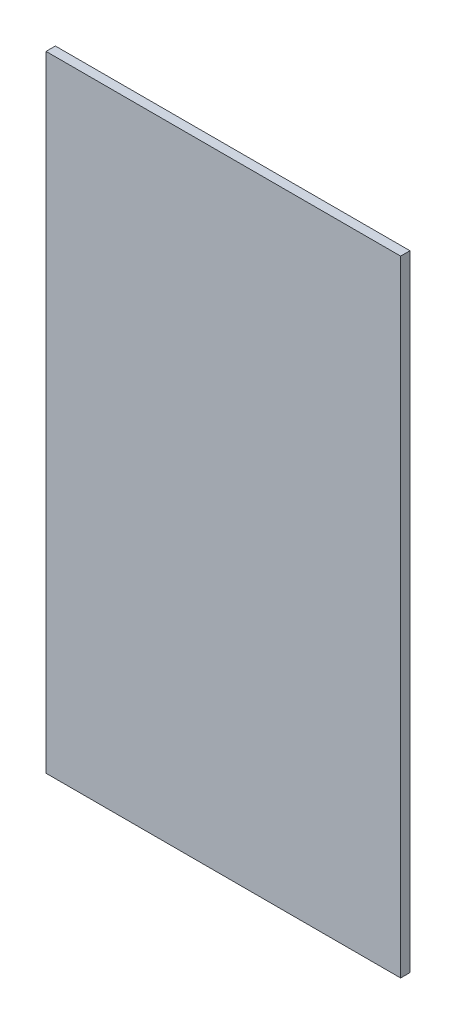
ISO-10303-21;
HEADER;
FILE_DESCRIPTION(('STEP AP214'),'2;1');
FILE_NAME('part.step','',(''),(''),'','','');
FILE_SCHEMA(('AUTOMOTIVE_DESIGN { 1 0 10303 214 1 1 1 1 }'));
ENDSEC;
DATA;
#1=APPLICATION_CONTEXT('core data for automotive mechanical design processes');
#2=APPLICATION_PROTOCOL_DEFINITION('international standard','automotive_design',2000,#1);
#3=PRODUCT_CONTEXT('',#1,'mechanical');
#4=PRODUCT('Part','Part','',(#3));
#5=PRODUCT_RELATED_PRODUCT_CATEGORY('part','',(#4));
#6=PRODUCT_DEFINITION_FORMATION('','',#4);
#7=PRODUCT_DEFINITION_CONTEXT('part definition',#1,'design');
#8=PRODUCT_DEFINITION('design','',#6,#7);
#9=PRODUCT_DEFINITION_SHAPE('','',#8);
#10=(LENGTH_UNIT() NAMED_UNIT(*) SI_UNIT(.MILLI.,.METRE.));
#11=(NAMED_UNIT(*) PLANE_ANGLE_UNIT() SI_UNIT($,.RADIAN.));
#12=(NAMED_UNIT(*) SI_UNIT($,.STERADIAN.) SOLID_ANGLE_UNIT());
#13=UNCERTAINTY_MEASURE_WITH_UNIT(LENGTH_MEASURE(1.E-05),#10,'distance_accuracy_value','');
#14=(GEOMETRIC_REPRESENTATION_CONTEXT(3) GLOBAL_UNCERTAINTY_ASSIGNED_CONTEXT((#13)) GLOBAL_UNIT_ASSIGNED_CONTEXT((#10,
#11,#12)) REPRESENTATION_CONTEXT('',''));
#15=CARTESIAN_POINT('',(0.,0.,0.));
#16=DIRECTION('',(0.,0.,1.));
#17=DIRECTION('',(1.,0.,0.));
#18=AXIS2_PLACEMENT_3D('',#15,#16,#17);
#19=CARTESIAN_POINT('',(-190.,335.,10.));
#20=DIRECTION('',(1.,0.,0.));
#21=DIRECTION('',(0.,1.,0.));
#22=AXIS2_PLACEMENT_3D('',#19,#20,#21);
#23=PLANE('',#22);
#24=DIRECTION('',(0.,-1.,0.));
#25=VECTOR('',#24,1.);
#26=CARTESIAN_POINT('',(-190.,335.,0.));
#27=LINE('',#26,#25);
#28=CARTESIAN_POINT('',(-190.,335.,0.));
#29=VERTEX_POINT('',#28);
#30=CARTESIAN_POINT('',(-190.,-335.,0.));
#31=VERTEX_POINT('',#30);
#32=EDGE_CURVE('E96',#29,#31,#27,.T.);
#33=ORIENTED_EDGE('',*,*,#32,.T.);
#34=DIRECTION('',(0.,0.,-1.));
#35=VECTOR('',#34,1.);
#36=CARTESIAN_POINT('',(-190.,-335.,10.));
#37=LINE('',#36,#35);
#38=CARTESIAN_POINT('',(-190.,-335.,10.));
#39=VERTEX_POINT('',#38);
#40=EDGE_CURVE('E11',#39,#31,#37,.T.);
#41=ORIENTED_EDGE('',*,*,#40,.F.);
#42=DIRECTION('',(0.,-1.,0.));
#43=VECTOR('',#42,1.);
#44=CARTESIAN_POINT('',(-190.,335.,10.));
#45=LINE('',#44,#43);
#46=CARTESIAN_POINT('',(-190.,335.,10.));
#47=VERTEX_POINT('',#46);
#48=EDGE_CURVE('E84',#47,#39,#45,.T.);
#49=ORIENTED_EDGE('',*,*,#48,.F.);
#50=DIRECTION('',(0.,0.,-1.));
#51=VECTOR('',#50,1.);
#52=CARTESIAN_POINT('',(-190.,335.,10.));
#53=LINE('',#52,#51);
#54=EDGE_CURVE('E92',#47,#29,#53,.T.);
#55=ORIENTED_EDGE('',*,*,#54,.T.);
#56=EDGE_LOOP('',(#33,#41,#49,#55));
#57=FACE_BOUND('',#56,.T.);
#58=ADVANCED_FACE('F33',(#57),#23,.F.);
#59=CARTESIAN_POINT('',(-190.,-335.,10.));
#60=DIRECTION('',(0.,1.,0.));
#61=DIRECTION('',(0.,0.,1.));
#62=AXIS2_PLACEMENT_3D('',#59,#60,#61);
#63=PLANE('',#62);
#64=DIRECTION('',(1.,0.,0.));
#65=VECTOR('',#64,1.);
#66=CARTESIAN_POINT('',(-190.,-335.,0.));
#67=LINE('',#66,#65);
#68=CARTESIAN_POINT('',(190.,-335.,0.));
#69=VERTEX_POINT('',#68);
#70=EDGE_CURVE('E88',#31,#69,#67,.T.);
#71=ORIENTED_EDGE('',*,*,#70,.T.);
#72=DIRECTION('',(0.,0.,-1.));
#73=VECTOR('',#72,1.);
#74=CARTESIAN_POINT('',(190.,-335.,10.));
#75=LINE('',#74,#73);
#76=CARTESIAN_POINT('',(190.,-335.,10.));
#77=VERTEX_POINT('',#76);
#78=EDGE_CURVE('E41',#77,#69,#75,.T.);
#79=ORIENTED_EDGE('',*,*,#78,.F.);
#80=DIRECTION('',(1.,0.,0.));
#81=VECTOR('',#80,1.);
#82=CARTESIAN_POINT('',(-190.,-335.,10.));
#83=LINE('',#82,#81);
#84=EDGE_CURVE('E79',#39,#77,#83,.T.);
#85=ORIENTED_EDGE('',*,*,#84,.F.);
#86=ORIENTED_EDGE('',*,*,#40,.T.);
#87=EDGE_LOOP('',(#71,#79,#85,#86));
#88=FACE_BOUND('',#87,.T.);
#89=ADVANCED_FACE('F87',(#88),#63,.F.);
#90=CARTESIAN_POINT('',(190.,335.,10.));
#91=DIRECTION('',(-1.,0.,0.));
#92=DIRECTION('',(0.,-1.,0.));
#93=AXIS2_PLACEMENT_3D('',#90,#91,#92);
#94=PLANE('',#93);
#95=DIRECTION('',(0.,1.,0.));
#96=VECTOR('',#95,1.);
#97=CARTESIAN_POINT('',(190.,335.,0.));
#98=LINE('',#97,#96);
#99=CARTESIAN_POINT('',(190.,335.,0.));
#100=VERTEX_POINT('',#99);
#101=EDGE_CURVE('E66',#69,#100,#98,.T.);
#102=ORIENTED_EDGE('',*,*,#101,.T.);
#103=DIRECTION('',(0.,0.,-1.));
#104=VECTOR('',#103,1.);
#105=CARTESIAN_POINT('',(190.,335.,10.));
#106=LINE('',#105,#104);
#107=CARTESIAN_POINT('',(190.,335.,10.));
#108=VERTEX_POINT('',#107);
#109=EDGE_CURVE('E89',#108,#100,#106,.T.);
#110=ORIENTED_EDGE('',*,*,#109,.F.);
#111=DIRECTION('',(0.,1.,0.));
#112=VECTOR('',#111,1.);
#113=CARTESIAN_POINT('',(190.,335.,10.));
#114=LINE('',#113,#112);
#115=EDGE_CURVE('E82',#77,#108,#114,.T.);
#116=ORIENTED_EDGE('',*,*,#115,.F.);
#117=ORIENTED_EDGE('',*,*,#78,.T.);
#118=EDGE_LOOP('',(#102,#110,#116,#117));
#119=FACE_BOUND('',#118,.T.);
#120=ADVANCED_FACE('F90',(#119),#94,.F.);
#121=CARTESIAN_POINT('',(-190.,335.,10.));
#122=DIRECTION('',(0.,-1.,0.));
#123=DIRECTION('',(0.,0.,-1.));
#124=AXIS2_PLACEMENT_3D('',#121,#122,#123);
#125=PLANE('',#124);
#126=DIRECTION('',(-1.,0.,0.));
#127=VECTOR('',#126,1.);
#128=CARTESIAN_POINT('',(-190.,335.,0.));
#129=LINE('',#128,#127);
#130=EDGE_CURVE('E72',#100,#29,#129,.T.);
#131=ORIENTED_EDGE('',*,*,#130,.T.);
#132=ORIENTED_EDGE('',*,*,#54,.F.);
#133=DIRECTION('',(-1.,0.,0.));
#134=VECTOR('',#133,1.);
#135=CARTESIAN_POINT('',(-190.,335.,10.));
#136=LINE('',#135,#134);
#137=EDGE_CURVE('E49',#108,#47,#136,.T.);
#138=ORIENTED_EDGE('',*,*,#137,.F.);
#139=ORIENTED_EDGE('',*,*,#109,.T.);
#140=EDGE_LOOP('',(#131,#132,#138,#139));
#141=FACE_BOUND('',#140,.T.);
#142=ADVANCED_FACE('F103',(#141),#125,.F.);
#143=CARTESIAN_POINT('',(0.,0.,10.));
#144=DIRECTION('',(0.,0.,1.));
#145=DIRECTION('',(1.,0.,0.));
#146=AXIS2_PLACEMENT_3D('',#143,#144,#145);
#147=PLANE('',#146);
#148=ORIENTED_EDGE('',*,*,#48,.T.);
#149=ORIENTED_EDGE('',*,*,#84,.T.);
#150=ORIENTED_EDGE('',*,*,#115,.T.);
#151=ORIENTED_EDGE('',*,*,#137,.T.);
#152=EDGE_LOOP('',(#148,#149,#150,#151));
#153=FACE_BOUND('',#152,.T.);
#154=ADVANCED_FACE('F80',(#153),#147,.T.);
#155=CARTESIAN_POINT('',(0.,0.,0.));
#156=DIRECTION('',(0.,0.,1.));
#157=DIRECTION('',(1.,0.,0.));
#158=AXIS2_PLACEMENT_3D('',#155,#156,#157);
#159=PLANE('',#158);
#160=ORIENTED_EDGE('',*,*,#32,.F.);
#161=ORIENTED_EDGE('',*,*,#130,.F.);
#162=ORIENTED_EDGE('',*,*,#101,.F.);
#163=ORIENTED_EDGE('',*,*,#70,.F.);
#164=EDGE_LOOP('',(#160,#161,#162,#163));
#165=FACE_BOUND('',#164,.T.);
#166=ADVANCED_FACE('F106',(#165),#159,.F.);
#167=CLOSED_SHELL('',(#58,#89,#120,#142,#154,#166));
#168=MANIFOLD_SOLID_BREP('B2',#167);
#169=ADVANCED_BREP_SHAPE_REPRESENTATION('',(#18,#168),#14);
#170=SHAPE_DEFINITION_REPRESENTATION(#9,#169);
ENDSEC;
END-ISO-10303-21;
